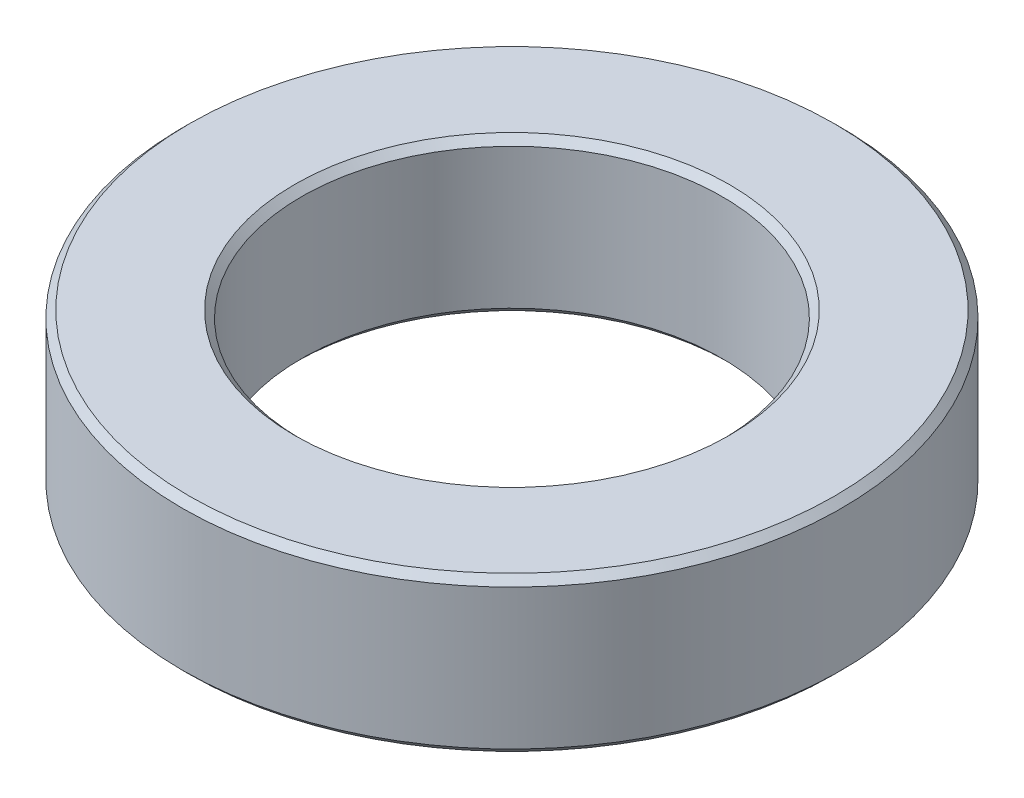
ISO-10303-21;
HEADER;
FILE_DESCRIPTION(('STEP AP214'),'2;1');
FILE_NAME('part.step','',(''),(''),'','','');
FILE_SCHEMA(('AUTOMOTIVE_DESIGN { 1 0 10303 214 1 1 1 1 }'));
ENDSEC;
DATA;
#1=APPLICATION_CONTEXT('core data for automotive mechanical design processes');
#2=APPLICATION_PROTOCOL_DEFINITION('international standard','automotive_design',2000,#1);
#3=PRODUCT_CONTEXT('',#1,'mechanical');
#4=PRODUCT('Part','Part','',(#3));
#5=PRODUCT_RELATED_PRODUCT_CATEGORY('part','',(#4));
#6=PRODUCT_DEFINITION_FORMATION('','',#4);
#7=PRODUCT_DEFINITION_CONTEXT('part definition',#1,'design');
#8=PRODUCT_DEFINITION('design','',#6,#7);
#9=PRODUCT_DEFINITION_SHAPE('','',#8);
#10=(LENGTH_UNIT() NAMED_UNIT(*) SI_UNIT(.MILLI.,.METRE.));
#11=(NAMED_UNIT(*) PLANE_ANGLE_UNIT() SI_UNIT($,.RADIAN.));
#12=(NAMED_UNIT(*) SI_UNIT($,.STERADIAN.) SOLID_ANGLE_UNIT());
#13=UNCERTAINTY_MEASURE_WITH_UNIT(LENGTH_MEASURE(1.E-05),#10,'distance_accuracy_value','');
#14=(GEOMETRIC_REPRESENTATION_CONTEXT(3) GLOBAL_UNCERTAINTY_ASSIGNED_CONTEXT((#13)) GLOBAL_UNIT_ASSIGNED_CONTEXT((#10,
#11,#12)) REPRESENTATION_CONTEXT('',''));
#15=CARTESIAN_POINT('',(0.,0.,0.));
#16=DIRECTION('',(0.,0.,1.));
#17=DIRECTION('',(1.,0.,0.));
#18=AXIS2_PLACEMENT_3D('',#15,#16,#17);
#19=CARTESIAN_POINT('',(0.,11.,0.));
#20=DIRECTION('',(0.,1.,0.));
#21=DIRECTION('',(0.,0.,1.));
#22=AXIS2_PLACEMENT_3D('',#19,#20,#21);
#23=PLANE('',#22);
#24=CARTESIAN_POINT('',(0.,11.,0.));
#25=DIRECTION('',(0.,1.,0.));
#26=DIRECTION('',(0.,0.,1.));
#27=AXIS2_PLACEMENT_3D('',#24,#25,#26);
#28=CIRCLE('',#27,15.5);
#29=CARTESIAN_POINT('',(0.,11.,15.5));
#30=VERTEX_POINT('',#29);
#31=EDGE_CURVE('E10',#30,#30,#28,.F.);
#32=ORIENTED_EDGE('',*,*,#31,.T.);
#33=EDGE_LOOP('',(#32));
#34=FACE_BOUND('',#33,.T.);
#35=CARTESIAN_POINT('',(0.,11.,0.));
#36=DIRECTION('',(0.,1.,0.));
#37=DIRECTION('',(0.,0.,1.));
#38=AXIS2_PLACEMENT_3D('',#35,#36,#37);
#39=CIRCLE('',#38,23.);
#40=CARTESIAN_POINT('',(0.,11.,23.));
#41=VERTEX_POINT('',#40);
#42=EDGE_CURVE('E48',#41,#41,#39,.T.);
#43=ORIENTED_EDGE('',*,*,#42,.T.);
#44=EDGE_LOOP('',(#43));
#45=FACE_BOUND('',#44,.T.);
#46=ADVANCED_FACE('F39',(#34,#45),#23,.T.);
#47=CARTESIAN_POINT('',(0.,0.,0.));
#48=DIRECTION('',(0.,1.,0.));
#49=DIRECTION('',(0.,0.,1.));
#50=AXIS2_PLACEMENT_3D('',#47,#48,#49);
#51=PLANE('',#50);
#52=CARTESIAN_POINT('',(0.,0.,0.));
#53=DIRECTION('',(0.,1.,0.));
#54=DIRECTION('',(0.,0.,1.));
#55=AXIS2_PLACEMENT_3D('',#52,#53,#54);
#56=CIRCLE('',#55,23.);
#57=CARTESIAN_POINT('',(0.,0.,23.));
#58=VERTEX_POINT('',#57);
#59=EDGE_CURVE('E64',#58,#58,#56,.F.);
#60=ORIENTED_EDGE('',*,*,#59,.T.);
#61=EDGE_LOOP('',(#60));
#62=FACE_BOUND('',#61,.T.);
#63=CARTESIAN_POINT('',(0.,0.,0.));
#64=DIRECTION('',(0.,1.,0.));
#65=DIRECTION('',(0.,0.,1.));
#66=AXIS2_PLACEMENT_3D('',#63,#64,#65);
#67=CIRCLE('',#66,15.5);
#68=CARTESIAN_POINT('',(0.,0.,15.5));
#69=VERTEX_POINT('',#68);
#70=EDGE_CURVE('E68',#69,#69,#67,.T.);
#71=ORIENTED_EDGE('',*,*,#70,.T.);
#72=EDGE_LOOP('',(#71));
#73=FACE_BOUND('',#72,.T.);
#74=ADVANCED_FACE('F92',(#62,#73),#51,.F.);
#75=CARTESIAN_POINT('',(0.,11.,0.));
#76=DIRECTION('',(0.,-1.,0.));
#77=DIRECTION('',(0.,0.,-1.));
#78=AXIS2_PLACEMENT_3D('',#75,#76,#77);
#79=CYLINDRICAL_SURFACE('',#78,23.5);
#80=CARTESIAN_POINT('',(0.,0.5,0.));
#81=DIRECTION('',(0.,1.,0.));
#82=DIRECTION('',(0.,0.,1.));
#83=AXIS2_PLACEMENT_3D('',#80,#81,#82);
#84=CIRCLE('',#83,23.5);
#85=CARTESIAN_POINT('',(0.,0.5,23.5));
#86=VERTEX_POINT('',#85);
#87=EDGE_CURVE('E72',#86,#86,#84,.T.);
#88=ORIENTED_EDGE('',*,*,#87,.T.);
#89=EDGE_LOOP('',(#88));
#90=FACE_BOUND('',#89,.T.);
#91=CARTESIAN_POINT('',(0.,10.5,0.));
#92=DIRECTION('',(0.,1.,0.));
#93=DIRECTION('',(0.,0.,1.));
#94=AXIS2_PLACEMENT_3D('',#91,#92,#93);
#95=CIRCLE('',#94,23.5);
#96=CARTESIAN_POINT('',(0.,10.5,23.5));
#97=VERTEX_POINT('',#96);
#98=EDGE_CURVE('E76',#97,#97,#95,.F.);
#99=ORIENTED_EDGE('',*,*,#98,.T.);
#100=EDGE_LOOP('',(#99));
#101=FACE_BOUND('',#100,.T.);
#102=ADVANCED_FACE('F81',(#90,#101),#79,.T.);
#103=CARTESIAN_POINT('',(0.,11.,0.));
#104=DIRECTION('',(0.,-1.,0.));
#105=DIRECTION('',(0.,0.,-1.));
#106=AXIS2_PLACEMENT_3D('',#103,#104,#105);
#107=CYLINDRICAL_SURFACE('',#106,15.);
#108=CARTESIAN_POINT('',(0.,0.49999999999999,0.));
#109=DIRECTION('',(0.,1.,0.));
#110=DIRECTION('',(0.,0.,1.));
#111=AXIS2_PLACEMENT_3D('',#108,#109,#110);
#112=CIRCLE('',#111,15.);
#113=CARTESIAN_POINT('',(0.,0.49999999999999,15.));
#114=VERTEX_POINT('',#113);
#115=EDGE_CURVE('E53',#114,#114,#112,.F.);
#116=ORIENTED_EDGE('',*,*,#115,.T.);
#117=EDGE_LOOP('',(#116));
#118=FACE_BOUND('',#117,.T.);
#119=CARTESIAN_POINT('',(0.,10.5,0.));
#120=DIRECTION('',(0.,1.,0.));
#121=DIRECTION('',(0.,0.,1.));
#122=AXIS2_PLACEMENT_3D('',#119,#120,#121);
#123=CIRCLE('',#122,15.);
#124=CARTESIAN_POINT('',(0.,10.5,15.));
#125=VERTEX_POINT('',#124);
#126=EDGE_CURVE('E58',#125,#125,#123,.T.);
#127=ORIENTED_EDGE('',*,*,#126,.T.);
#128=EDGE_LOOP('',(#127));
#129=FACE_BOUND('',#128,.T.);
#130=ADVANCED_FACE('F100',(#118,#129),#107,.F.);
#131=CARTESIAN_POINT('',(0.,0.5,0.));
#132=DIRECTION('',(0.,1.,0.));
#133=DIRECTION('',(0.,0.,1.));
#134=AXIS2_PLACEMENT_3D('',#131,#132,#133);
#135=CONICAL_SURFACE('',#134,23.5,0.785398163397448);
#136=ORIENTED_EDGE('',*,*,#59,.F.);
#137=EDGE_LOOP('',(#136));
#138=FACE_BOUND('',#137,.T.);
#139=ORIENTED_EDGE('',*,*,#87,.F.);
#140=EDGE_LOOP('',(#139));
#141=FACE_BOUND('',#140,.T.);
#142=ADVANCED_FACE('F106',(#138,#141),#135,.T.);
#143=CARTESIAN_POINT('',(0.,0.,0.));
#144=DIRECTION('',(0.,-1.,0.));
#145=DIRECTION('',(0.,0.,-1.));
#146=AXIS2_PLACEMENT_3D('',#143,#144,#145);
#147=CONICAL_SURFACE('',#146,15.5,0.78539816339745);
#148=ORIENTED_EDGE('',*,*,#115,.F.);
#149=EDGE_LOOP('',(#148));
#150=FACE_BOUND('',#149,.T.);
#151=ORIENTED_EDGE('',*,*,#70,.F.);
#152=EDGE_LOOP('',(#151));
#153=FACE_BOUND('',#152,.T.);
#154=ADVANCED_FACE('F89',(#150,#153),#147,.F.);
#155=CARTESIAN_POINT('',(0.,10.5,0.));
#156=DIRECTION('',(0.,1.,0.));
#157=DIRECTION('',(0.,0.,1.));
#158=AXIS2_PLACEMENT_3D('',#155,#156,#157);
#159=CONICAL_SURFACE('',#158,15.,0.785398163397452);
#160=ORIENTED_EDGE('',*,*,#31,.F.);
#161=EDGE_LOOP('',(#160));
#162=FACE_BOUND('',#161,.T.);
#163=ORIENTED_EDGE('',*,*,#126,.F.);
#164=EDGE_LOOP('',(#163));
#165=FACE_BOUND('',#164,.T.);
#166=ADVANCED_FACE('F85',(#162,#165),#159,.F.);
#167=CARTESIAN_POINT('',(0.,11.,0.));
#168=DIRECTION('',(0.,-1.,0.));
#169=DIRECTION('',(0.,0.,-1.));
#170=AXIS2_PLACEMENT_3D('',#167,#168,#169);
#171=CONICAL_SURFACE('',#170,23.,0.785398163397455);
#172=ORIENTED_EDGE('',*,*,#98,.F.);
#173=EDGE_LOOP('',(#172));
#174=FACE_BOUND('',#173,.T.);
#175=ORIENTED_EDGE('',*,*,#42,.F.);
#176=EDGE_LOOP('',(#175));
#177=FACE_BOUND('',#176,.T.);
#178=ADVANCED_FACE('F42',(#174,#177),#171,.T.);
#179=CLOSED_SHELL('',(#46,#74,#102,#130,#142,#154,#166,#178));
#180=MANIFOLD_SOLID_BREP('B2',#179);
#181=ADVANCED_BREP_SHAPE_REPRESENTATION('',(#18,#180),#14);
#182=SHAPE_DEFINITION_REPRESENTATION(#9,#181);
ENDSEC;
END-ISO-10303-21;
